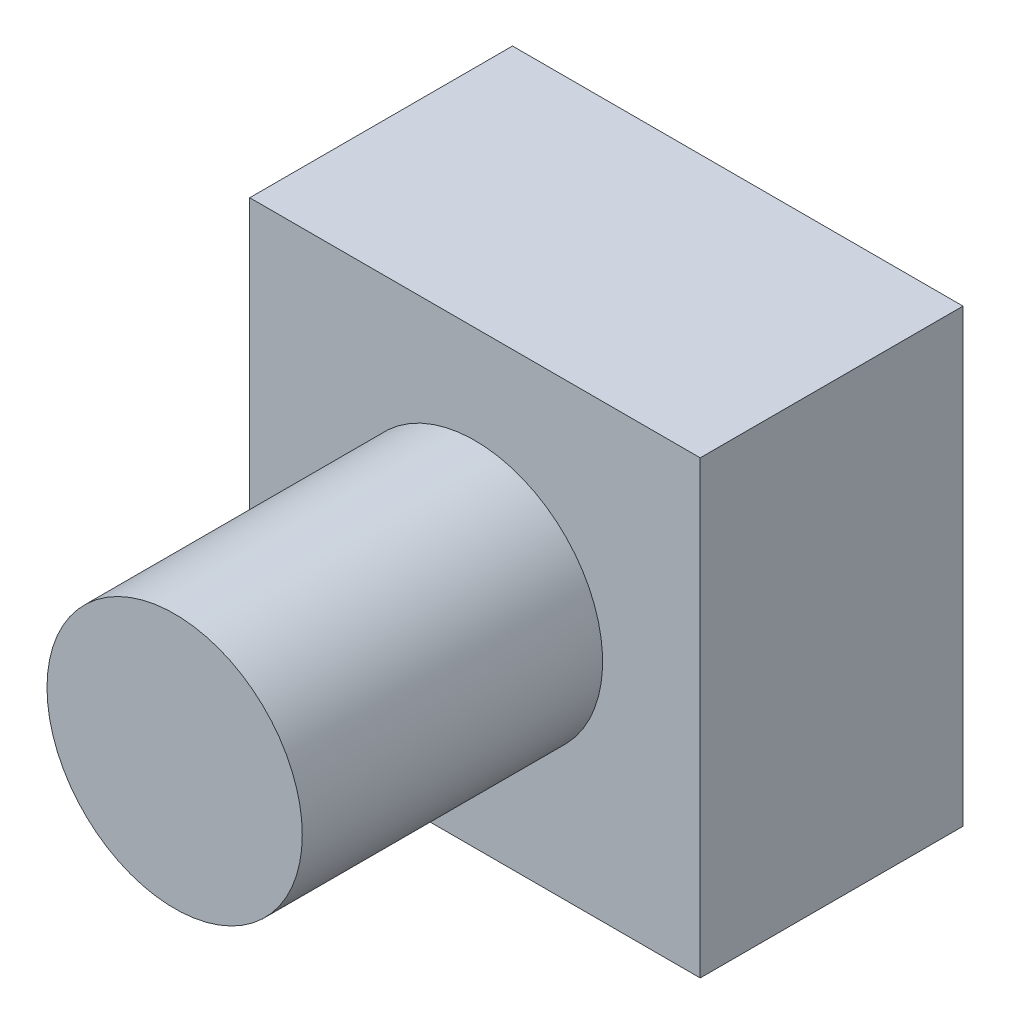
ISO-10303-21;
HEADER;
FILE_DESCRIPTION(('STEP AP214'),'2;1');
FILE_NAME('part.step','',(''),(''),'','','');
FILE_SCHEMA(('AUTOMOTIVE_DESIGN { 1 0 10303 214 1 1 1 1 }'));
ENDSEC;
DATA;
#1=APPLICATION_CONTEXT('core data for automotive mechanical design processes');
#2=APPLICATION_PROTOCOL_DEFINITION('international standard','automotive_design',2000,#1);
#3=PRODUCT_CONTEXT('',#1,'mechanical');
#4=PRODUCT('Part','Part','',(#3));
#5=PRODUCT_RELATED_PRODUCT_CATEGORY('part','',(#4));
#6=PRODUCT_DEFINITION_FORMATION('','',#4);
#7=PRODUCT_DEFINITION_CONTEXT('part definition',#1,'design');
#8=PRODUCT_DEFINITION('design','',#6,#7);
#9=PRODUCT_DEFINITION_SHAPE('','',#8);
#10=(LENGTH_UNIT() NAMED_UNIT(*) SI_UNIT(.MILLI.,.METRE.));
#11=(NAMED_UNIT(*) PLANE_ANGLE_UNIT() SI_UNIT($,.RADIAN.));
#12=(NAMED_UNIT(*) SI_UNIT($,.STERADIAN.) SOLID_ANGLE_UNIT());
#13=UNCERTAINTY_MEASURE_WITH_UNIT(LENGTH_MEASURE(1.E-05),#10,'distance_accuracy_value','');
#14=(GEOMETRIC_REPRESENTATION_CONTEXT(3) GLOBAL_UNCERTAINTY_ASSIGNED_CONTEXT((#13)) GLOBAL_UNIT_ASSIGNED_CONTEXT((#10,
#11,#12)) REPRESENTATION_CONTEXT('',''));
#15=CARTESIAN_POINT('',(0.,0.,0.));
#16=DIRECTION('',(0.,0.,1.));
#17=DIRECTION('',(1.,0.,0.));
#18=AXIS2_PLACEMENT_3D('',#15,#16,#17);
#19=CARTESIAN_POINT('',(0.,0.,3.5));
#20=DIRECTION('',(0.,0.,-1.));
#21=DIRECTION('',(-1.,0.,0.));
#22=AXIS2_PLACEMENT_3D('',#19,#20,#21);
#23=PLANE('',#22);
#24=DIRECTION('',(0.,-1.,0.));
#25=VECTOR('',#24,1.);
#26=CARTESIAN_POINT('',(0.,0.,3.5));
#27=LINE('',#26,#25);
#28=CARTESIAN_POINT('',(0.,5.99999999999998,3.5));
#29=VERTEX_POINT('',#28);
#30=CARTESIAN_POINT('',(0.,0.,3.5));
#31=VERTEX_POINT('',#30);
#32=EDGE_CURVE('E85',#29,#31,#27,.T.);
#33=ORIENTED_EDGE('',*,*,#32,.T.);
#34=DIRECTION('',(1.,0.,0.));
#35=VECTOR('',#34,1.);
#36=CARTESIAN_POINT('',(0.,0.,3.5));
#37=LINE('',#36,#35);
#38=CARTESIAN_POINT('',(6.00000000000001,0.,3.5));
#39=VERTEX_POINT('',#38);
#40=EDGE_CURVE('E80',#31,#39,#37,.T.);
#41=ORIENTED_EDGE('',*,*,#40,.T.);
#42=DIRECTION('',(0.,1.,0.));
#43=VECTOR('',#42,1.);
#44=CARTESIAN_POINT('',(6.00000000000001,0.,3.5));
#45=LINE('',#44,#43);
#46=CARTESIAN_POINT('',(6.,5.99999999999999,3.5));
#47=VERTEX_POINT('',#46);
#48=EDGE_CURVE('E83',#39,#47,#45,.T.);
#49=ORIENTED_EDGE('',*,*,#48,.T.);
#50=DIRECTION('',(-1.,0.,0.));
#51=VECTOR('',#50,1.);
#52=CARTESIAN_POINT('',(0.,5.99999999999998,3.5));
#53=LINE('',#52,#51);
#54=EDGE_CURVE('E49',#47,#29,#53,.T.);
#55=ORIENTED_EDGE('',*,*,#54,.T.);
#56=EDGE_LOOP('',(#33,#41,#49,#55));
#57=FACE_BOUND('',#56,.T.);
#58=CARTESIAN_POINT('',(3.,2.99999999999999,3.5));
#59=DIRECTION('',(0.,0.,-1.));
#60=DIRECTION('',(-1.,0.,0.));
#61=AXIS2_PLACEMENT_3D('',#58,#59,#60);
#62=CIRCLE('',#61,1.7);
#63=CARTESIAN_POINT('',(1.3,2.99999999999999,3.5));
#64=VERTEX_POINT('',#63);
#65=EDGE_CURVE('E11',#64,#64,#62,.F.);
#66=ORIENTED_EDGE('',*,*,#65,.F.);
#67=EDGE_LOOP('',(#66));
#68=FACE_BOUND('',#67,.T.);
#69=ADVANCED_FACE('F32',(#57,#68),#23,.F.);
#70=CARTESIAN_POINT('',(0.,0.,3.5));
#71=DIRECTION('',(1.,0.,0.));
#72=DIRECTION('',(0.,1.,0.));
#73=AXIS2_PLACEMENT_3D('',#70,#71,#72);
#74=PLANE('',#73);
#75=DIRECTION('',(0.,-1.,0.));
#76=VECTOR('',#75,1.);
#77=CARTESIAN_POINT('',(0.,0.,0.));
#78=LINE('',#77,#76);
#79=CARTESIAN_POINT('',(0.,5.99999999999998,0.));
#80=VERTEX_POINT('',#79);
#81=CARTESIAN_POINT('',(0.,0.,0.));
#82=VERTEX_POINT('',#81);
#83=EDGE_CURVE('E99',#80,#82,#78,.T.);
#84=ORIENTED_EDGE('',*,*,#83,.T.);
#85=DIRECTION('',(0.,0.,-1.));
#86=VECTOR('',#85,1.);
#87=CARTESIAN_POINT('',(0.,0.,3.5));
#88=LINE('',#87,#86);
#89=EDGE_CURVE('E41',#31,#82,#88,.T.);
#90=ORIENTED_EDGE('',*,*,#89,.F.);
#91=ORIENTED_EDGE('',*,*,#32,.F.);
#92=DIRECTION('',(0.,0.,-1.));
#93=VECTOR('',#92,1.);
#94=CARTESIAN_POINT('',(0.,5.99999999999998,3.5));
#95=LINE('',#94,#93);
#96=EDGE_CURVE('E95',#29,#80,#95,.T.);
#97=ORIENTED_EDGE('',*,*,#96,.T.);
#98=EDGE_LOOP('',(#84,#90,#91,#97));
#99=FACE_BOUND('',#98,.T.);
#100=ADVANCED_FACE('F34',(#99),#74,.F.);
#101=CARTESIAN_POINT('',(0.,0.,3.5));
#102=DIRECTION('',(0.,1.,0.));
#103=DIRECTION('',(0.,0.,1.));
#104=AXIS2_PLACEMENT_3D('',#101,#102,#103);
#105=PLANE('',#104);
#106=DIRECTION('',(1.,0.,0.));
#107=VECTOR('',#106,1.);
#108=CARTESIAN_POINT('',(0.,0.,0.));
#109=LINE('',#108,#107);
#110=CARTESIAN_POINT('',(6.00000000000001,0.,0.));
#111=VERTEX_POINT('',#110);
#112=EDGE_CURVE('E90',#82,#111,#109,.T.);
#113=ORIENTED_EDGE('',*,*,#112,.T.);
#114=DIRECTION('',(0.,0.,-1.));
#115=VECTOR('',#114,1.);
#116=CARTESIAN_POINT('',(6.00000000000001,0.,3.5));
#117=LINE('',#116,#115);
#118=EDGE_CURVE('E88',#39,#111,#117,.T.);
#119=ORIENTED_EDGE('',*,*,#118,.F.);
#120=ORIENTED_EDGE('',*,*,#40,.F.);
#121=ORIENTED_EDGE('',*,*,#89,.T.);
#122=EDGE_LOOP('',(#113,#119,#120,#121));
#123=FACE_BOUND('',#122,.T.);
#124=ADVANCED_FACE('F89',(#123),#105,.F.);
#125=CARTESIAN_POINT('',(6.00000000000001,0.,3.5));
#126=DIRECTION('',(-1.,0.,0.));
#127=DIRECTION('',(0.,0.,1.));
#128=AXIS2_PLACEMENT_3D('',#125,#126,#127);
#129=PLANE('',#128);
#130=DIRECTION('',(0.,1.,0.));
#131=VECTOR('',#130,1.);
#132=CARTESIAN_POINT('',(6.00000000000001,0.,0.));
#133=LINE('',#132,#131);
#134=CARTESIAN_POINT('',(6.,5.99999999999999,0.));
#135=VERTEX_POINT('',#134);
#136=EDGE_CURVE('E66',#111,#135,#133,.T.);
#137=ORIENTED_EDGE('',*,*,#136,.T.);
#138=DIRECTION('',(0.,0.,-1.));
#139=VECTOR('',#138,1.);
#140=CARTESIAN_POINT('',(6.,5.99999999999999,3.5));
#141=LINE('',#140,#139);
#142=EDGE_CURVE('E91',#47,#135,#141,.T.);
#143=ORIENTED_EDGE('',*,*,#142,.F.);
#144=ORIENTED_EDGE('',*,*,#48,.F.);
#145=ORIENTED_EDGE('',*,*,#118,.T.);
#146=EDGE_LOOP('',(#137,#143,#144,#145));
#147=FACE_BOUND('',#146,.T.);
#148=ADVANCED_FACE('F93',(#147),#129,.F.);
#149=CARTESIAN_POINT('',(0.,5.99999999999998,3.5));
#150=DIRECTION('',(0.,-1.,0.));
#151=DIRECTION('',(0.,0.,-1.));
#152=AXIS2_PLACEMENT_3D('',#149,#150,#151);
#153=PLANE('',#152);
#154=DIRECTION('',(-1.,0.,0.));
#155=VECTOR('',#154,1.);
#156=CARTESIAN_POINT('',(0.,5.99999999999998,0.));
#157=LINE('',#156,#155);
#158=EDGE_CURVE('E72',#135,#80,#157,.T.);
#159=ORIENTED_EDGE('',*,*,#158,.T.);
#160=ORIENTED_EDGE('',*,*,#96,.F.);
#161=ORIENTED_EDGE('',*,*,#54,.F.);
#162=ORIENTED_EDGE('',*,*,#142,.T.);
#163=EDGE_LOOP('',(#159,#160,#161,#162));
#164=FACE_BOUND('',#163,.T.);
#165=ADVANCED_FACE('F113',(#164),#153,.F.);
#166=CARTESIAN_POINT('',(0.,0.,0.));
#167=DIRECTION('',(0.,0.,-1.));
#168=DIRECTION('',(-1.,0.,0.));
#169=AXIS2_PLACEMENT_3D('',#166,#167,#168);
#170=PLANE('',#169);
#171=ORIENTED_EDGE('',*,*,#83,.F.);
#172=ORIENTED_EDGE('',*,*,#158,.F.);
#173=ORIENTED_EDGE('',*,*,#136,.F.);
#174=ORIENTED_EDGE('',*,*,#112,.F.);
#175=EDGE_LOOP('',(#171,#172,#173,#174));
#176=FACE_BOUND('',#175,.T.);
#177=ADVANCED_FACE('F110',(#176),#170,.T.);
#178=CARTESIAN_POINT('',(3.,2.99999999999999,7.50000000000001));
#179=DIRECTION('',(0.,0.,-1.));
#180=DIRECTION('',(-1.,0.,0.));
#181=AXIS2_PLACEMENT_3D('',#178,#179,#180);
#182=CYLINDRICAL_SURFACE('',#181,1.7);
#183=CARTESIAN_POINT('',(3.,2.99999999999999,7.50000000000001));
#184=DIRECTION('',(0.,0.,1.));
#185=DIRECTION('',(1.,0.,0.));
#186=AXIS2_PLACEMENT_3D('',#183,#184,#185);
#187=CIRCLE('',#186,1.7);
#188=CARTESIAN_POINT('',(4.7,2.99999999999999,7.50000000000001));
#189=VERTEX_POINT('',#188);
#190=EDGE_CURVE('E102',#189,#189,#187,.T.);
#191=ORIENTED_EDGE('',*,*,#190,.F.);
#192=EDGE_LOOP('',(#191));
#193=FACE_BOUND('',#192,.T.);
#194=ORIENTED_EDGE('',*,*,#65,.T.);
#195=EDGE_LOOP('',(#194));
#196=FACE_BOUND('',#195,.T.);
#197=ADVANCED_FACE('F112',(#193,#196),#182,.T.);
#198=CARTESIAN_POINT('',(3.,2.99999999999999,7.50000000000001));
#199=DIRECTION('',(0.,0.,1.));
#200=DIRECTION('',(1.,0.,0.));
#201=AXIS2_PLACEMENT_3D('',#198,#199,#200);
#202=PLANE('',#201);
#203=ORIENTED_EDGE('',*,*,#190,.T.);
#204=EDGE_LOOP('',(#203));
#205=FACE_BOUND('',#204,.T.);
#206=ADVANCED_FACE('F119',(#205),#202,.T.);
#207=CLOSED_SHELL('',(#69,#100,#124,#148,#165,#177,#197,#206));
#208=MANIFOLD_SOLID_BREP('B2',#207);
#209=ADVANCED_BREP_SHAPE_REPRESENTATION('',(#18,#208),#14);
#210=SHAPE_DEFINITION_REPRESENTATION(#9,#209);
ENDSEC;
END-ISO-10303-21;
